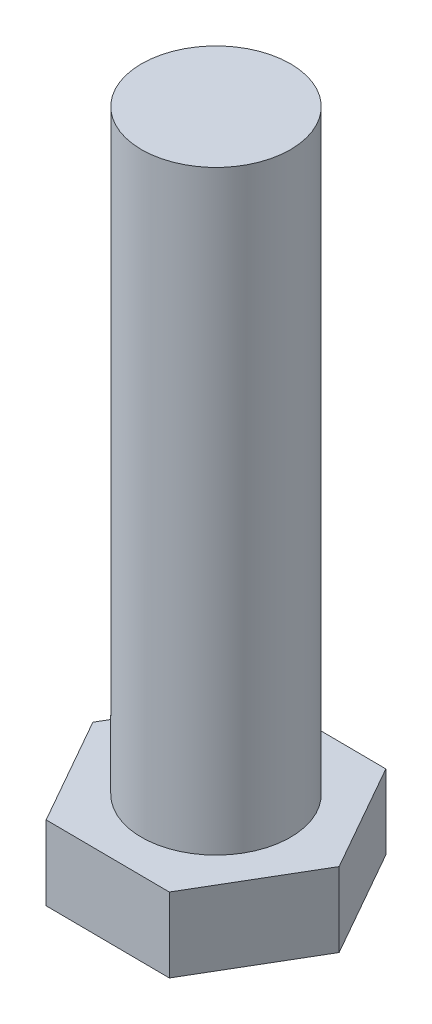
ISO-10303-21;
HEADER;
FILE_DESCRIPTION(('STEP AP214'),'2;1');
FILE_NAME('part.step','',(''),(''),'','','');
FILE_SCHEMA(('AUTOMOTIVE_DESIGN { 1 0 10303 214 1 1 1 1 }'));
ENDSEC;
DATA;
#1=APPLICATION_CONTEXT('core data for automotive mechanical design processes');
#2=APPLICATION_PROTOCOL_DEFINITION('international standard','automotive_design',2000,#1);
#3=PRODUCT_CONTEXT('',#1,'mechanical');
#4=PRODUCT('Part','Part','',(#3));
#5=PRODUCT_RELATED_PRODUCT_CATEGORY('part','',(#4));
#6=PRODUCT_DEFINITION_FORMATION('','',#4);
#7=PRODUCT_DEFINITION_CONTEXT('part definition',#1,'design');
#8=PRODUCT_DEFINITION('design','',#6,#7);
#9=PRODUCT_DEFINITION_SHAPE('','',#8);
#10=(LENGTH_UNIT() NAMED_UNIT(*) SI_UNIT(.MILLI.,.METRE.));
#11=(NAMED_UNIT(*) PLANE_ANGLE_UNIT() SI_UNIT($,.RADIAN.));
#12=(NAMED_UNIT(*) SI_UNIT($,.STERADIAN.) SOLID_ANGLE_UNIT());
#13=UNCERTAINTY_MEASURE_WITH_UNIT(LENGTH_MEASURE(1.E-05),#10,'distance_accuracy_value','');
#14=(GEOMETRIC_REPRESENTATION_CONTEXT(3) GLOBAL_UNCERTAINTY_ASSIGNED_CONTEXT((#13)) GLOBAL_UNIT_ASSIGNED_CONTEXT((#10,
#11,#12)) REPRESENTATION_CONTEXT('',''));
#15=CARTESIAN_POINT('',(0.,0.,0.));
#16=DIRECTION('',(0.,0.,1.));
#17=DIRECTION('',(1.,0.,0.));
#18=AXIS2_PLACEMENT_3D('',#15,#16,#17);
#19=CARTESIAN_POINT('',(0.,12.,0.));
#20=DIRECTION('',(0.,-1.,0.));
#21=DIRECTION('',(0.,0.,-1.));
#22=AXIS2_PLACEMENT_3D('',#19,#20,#21);
#23=CYLINDRICAL_SURFACE('',#22,1.5);
#24=CARTESIAN_POINT('',(0.,12.,0.));
#25=DIRECTION('',(0.,1.,0.));
#26=DIRECTION('',(0.,0.,1.));
#27=AXIS2_PLACEMENT_3D('',#24,#25,#26);
#28=CIRCLE('',#27,1.5);
#29=CARTESIAN_POINT('',(0.,12.,1.5));
#30=VERTEX_POINT('',#29);
#31=EDGE_CURVE('E11',#30,#30,#28,.T.);
#32=ORIENTED_EDGE('',*,*,#31,.F.);
#33=EDGE_LOOP('',(#32));
#34=FACE_BOUND('',#33,.T.);
#35=CARTESIAN_POINT('',(0.,0.,0.));
#36=DIRECTION('',(0.,-1.,0.));
#37=DIRECTION('',(0.,0.,-1.));
#38=AXIS2_PLACEMENT_3D('',#35,#36,#37);
#39=CIRCLE('',#38,1.5);
#40=CARTESIAN_POINT('',(0.,0.,-1.5));
#41=VERTEX_POINT('',#40);
#42=EDGE_CURVE('E43',#41,#41,#39,.T.);
#43=ORIENTED_EDGE('',*,*,#42,.F.);
#44=EDGE_LOOP('',(#43));
#45=FACE_BOUND('',#44,.T.);
#46=ADVANCED_FACE('F35',(#34,#45),#23,.T.);
#47=CARTESIAN_POINT('',(0.,12.,0.));
#48=DIRECTION('',(0.,1.,0.));
#49=DIRECTION('',(0.,0.,1.));
#50=AXIS2_PLACEMENT_3D('',#47,#48,#49);
#51=PLANE('',#50);
#52=ORIENTED_EDGE('',*,*,#31,.T.);
#53=EDGE_LOOP('',(#52));
#54=FACE_BOUND('',#53,.T.);
#55=ADVANCED_FACE('F145',(#54),#51,.T.);
#56=CARTESIAN_POINT('',(1.26636513009753,-1.5,-2.15561509719396));
#57=DIRECTION('',(-0.869779921870773,0.,0.493439851968274));
#58=DIRECTION('',(0.493439851968274,0.,0.869779921870773));
#59=AXIS2_PLACEMENT_3D('',#56,#57,#58);
#60=PLANE('',#59);
#61=DIRECTION('',(0.493439851968274,0.,0.869779921870773));
#62=VECTOR('',#61,1.);
#63=CARTESIAN_POINT('',(1.26636513009753,0.,-2.15561509719396));
#64=LINE('',#63,#62);
#65=CARTESIAN_POINT('',(1.26636513009753,0.,-2.15561509719396));
#66=VERTEX_POINT('',#65);
#67=CARTESIAN_POINT('',(2.5,0.,0.0188968245342703));
#68=VERTEX_POINT('',#67);
#69=EDGE_CURVE('E120',#66,#68,#64,.T.);
#70=ORIENTED_EDGE('',*,*,#69,.T.);
#71=DIRECTION('',(0.,1.,0.));
#72=VECTOR('',#71,1.);
#73=CARTESIAN_POINT('',(2.5,-1.5,0.0188968245342703));
#74=LINE('',#73,#72);
#75=CARTESIAN_POINT('',(2.5,-1.5,0.0188968245342703));
#76=VERTEX_POINT('',#75);
#77=EDGE_CURVE('E137',#76,#68,#74,.T.);
#78=ORIENTED_EDGE('',*,*,#77,.F.);
#79=DIRECTION('',(0.493439851968274,0.,0.869779921870773));
#80=VECTOR('',#79,1.);
#81=CARTESIAN_POINT('',(1.26636513009753,-1.5,-2.15561509719396));
#82=LINE('',#81,#80);
#83=CARTESIAN_POINT('',(1.26636513009753,-1.5,-2.15561509719396));
#84=VERTEX_POINT('',#83);
#85=EDGE_CURVE('E130',#84,#76,#82,.T.);
#86=ORIENTED_EDGE('',*,*,#85,.F.);
#87=DIRECTION('',(0.,1.,0.));
#88=VECTOR('',#87,1.);
#89=CARTESIAN_POINT('',(1.26636513009753,-1.5,-2.15561509719396));
#90=LINE('',#89,#88);
#91=EDGE_CURVE('E116',#84,#66,#90,.T.);
#92=ORIENTED_EDGE('',*,*,#91,.T.);
#93=EDGE_LOOP('',(#70,#78,#86,#92));
#94=FACE_BOUND('',#93,.T.);
#95=ADVANCED_FACE('F150',(#94),#60,.F.);
#96=CARTESIAN_POINT('',(2.5,-1.5,0.0188968245342703));
#97=DIRECTION('',(-0.862221407979545,0.,-0.506531582057596));
#98=DIRECTION('',(-0.506531582057596,0.,0.862221407979545));
#99=AXIS2_PLACEMENT_3D('',#96,#97,#98);
#100=PLANE('',#99);
#101=DIRECTION('',(-0.506531582057596,0.,0.862221407979545));
#102=VECTOR('',#101,1.);
#103=CARTESIAN_POINT('',(2.5,0.,0.0188968245342703));
#104=LINE('',#103,#102);
#105=CARTESIAN_POINT('',(1.23363486990247,0.,2.17451192172823));
#106=VERTEX_POINT('',#105);
#107=EDGE_CURVE('E123',#68,#106,#104,.T.);
#108=ORIENTED_EDGE('',*,*,#107,.T.);
#109=DIRECTION('',(0.,1.,0.));
#110=VECTOR('',#109,1.);
#111=CARTESIAN_POINT('',(1.23363486990247,-1.5,2.17451192172823));
#112=LINE('',#111,#110);
#113=CARTESIAN_POINT('',(1.23363486990247,-1.5,2.17451192172823));
#114=VERTEX_POINT('',#113);
#115=EDGE_CURVE('E134',#114,#106,#112,.T.);
#116=ORIENTED_EDGE('',*,*,#115,.F.);
#117=DIRECTION('',(-0.506531582057596,0.,0.862221407979545));
#118=VECTOR('',#117,1.);
#119=CARTESIAN_POINT('',(2.5,-1.5,0.0188968245342703));
#120=LINE('',#119,#118);
#121=EDGE_CURVE('E89',#76,#114,#120,.T.);
#122=ORIENTED_EDGE('',*,*,#121,.F.);
#123=ORIENTED_EDGE('',*,*,#77,.T.);
#124=EDGE_LOOP('',(#108,#116,#122,#123));
#125=FACE_BOUND('',#124,.T.);
#126=ADVANCED_FACE('F156',(#125),#100,.F.);
#127=CARTESIAN_POINT('',(1.23363486990247,-1.5,2.17451192172823));
#128=DIRECTION('',(0.00755851389122729,0.,-0.999971434025871));
#129=DIRECTION('',(-0.999971434025871,0.,-0.00755851389122729));
#130=AXIS2_PLACEMENT_3D('',#127,#128,#129);
#131=PLANE('',#130);
#132=DIRECTION('',(-0.999971434025871,0.,-0.00755851389122729));
#133=VECTOR('',#132,1.);
#134=CARTESIAN_POINT('',(1.23363486990247,0.,2.17451192172823));
#135=LINE('',#134,#133);
#136=CARTESIAN_POINT('',(-1.26636513009753,0.,2.15561509719396));
#137=VERTEX_POINT('',#136);
#138=EDGE_CURVE('E125',#106,#137,#135,.T.);
#139=ORIENTED_EDGE('',*,*,#138,.T.);
#140=DIRECTION('',(0.,1.,0.));
#141=VECTOR('',#140,1.);
#142=CARTESIAN_POINT('',(-1.26636513009753,-1.5,2.15561509719396));
#143=LINE('',#142,#141);
#144=CARTESIAN_POINT('',(-1.26636513009753,-1.5,2.15561509719396));
#145=VERTEX_POINT('',#144);
#146=EDGE_CURVE('E111',#145,#137,#143,.T.);
#147=ORIENTED_EDGE('',*,*,#146,.F.);
#148=DIRECTION('',(-0.999971434025871,0.,-0.00755851389122729));
#149=VECTOR('',#148,1.);
#150=CARTESIAN_POINT('',(1.23363486990247,-1.5,2.17451192172823));
#151=LINE('',#150,#149);
#152=EDGE_CURVE('E102',#114,#145,#151,.T.);
#153=ORIENTED_EDGE('',*,*,#152,.F.);
#154=ORIENTED_EDGE('',*,*,#115,.T.);
#155=EDGE_LOOP('',(#139,#147,#153,#154));
#156=FACE_BOUND('',#155,.T.);
#157=ADVANCED_FACE('F162',(#156),#131,.F.);
#158=CARTESIAN_POINT('',(-1.26636513009753,-1.5,2.15561509719396));
#159=DIRECTION('',(0.869779921870773,0.,-0.493439851968275));
#160=DIRECTION('',(-0.493439851968275,0.,-0.869779921870773));
#161=AXIS2_PLACEMENT_3D('',#158,#159,#160);
#162=PLANE('',#161);
#163=DIRECTION('',(-0.493439851968275,0.,-0.869779921870773));
#164=VECTOR('',#163,1.);
#165=CARTESIAN_POINT('',(-1.26636513009753,0.,2.15561509719396));
#166=LINE('',#165,#164);
#167=CARTESIAN_POINT('',(-2.5,0.,-0.0188968245342696));
#168=VERTEX_POINT('',#167);
#169=EDGE_CURVE('E110',#137,#168,#166,.T.);
#170=ORIENTED_EDGE('',*,*,#169,.T.);
#171=DIRECTION('',(0.,1.,0.));
#172=VECTOR('',#171,1.);
#173=CARTESIAN_POINT('',(-2.5,-1.5,-0.0188968245342696));
#174=LINE('',#173,#172);
#175=CARTESIAN_POINT('',(-2.5,-1.5,-0.0188968245342696));
#176=VERTEX_POINT('',#175);
#177=EDGE_CURVE('E107',#176,#168,#174,.T.);
#178=ORIENTED_EDGE('',*,*,#177,.F.);
#179=DIRECTION('',(-0.493439851968275,0.,-0.869779921870773));
#180=VECTOR('',#179,1.);
#181=CARTESIAN_POINT('',(-1.26636513009753,-1.5,2.15561509719396));
#182=LINE('',#181,#180);
#183=EDGE_CURVE('E96',#145,#176,#182,.T.);
#184=ORIENTED_EDGE('',*,*,#183,.F.);
#185=ORIENTED_EDGE('',*,*,#146,.T.);
#186=EDGE_LOOP('',(#170,#178,#184,#185));
#187=FACE_BOUND('',#186,.T.);
#188=ADVANCED_FACE('F108',(#187),#162,.F.);
#189=CARTESIAN_POINT('',(-2.5,-1.5,-0.0188968245342696));
#190=DIRECTION('',(0.862221407979545,0.,0.506531582057596));
#191=DIRECTION('',(0.506531582057596,0.,-0.862221407979545));
#192=AXIS2_PLACEMENT_3D('',#189,#190,#191);
#193=PLANE('',#192);
#194=DIRECTION('',(0.506531582057596,0.,-0.862221407979545));
#195=VECTOR('',#194,1.);
#196=CARTESIAN_POINT('',(-2.5,0.,-0.0188968245342696));
#197=LINE('',#196,#195);
#198=CARTESIAN_POINT('',(-1.23363486990247,0.,-2.17451192172823));
#199=VERTEX_POINT('',#198);
#200=EDGE_CURVE('E74',#168,#199,#197,.T.);
#201=ORIENTED_EDGE('',*,*,#200,.T.);
#202=DIRECTION('',(0.,1.,0.));
#203=VECTOR('',#202,1.);
#204=CARTESIAN_POINT('',(-1.23363486990247,-1.5,-2.17451192172823));
#205=LINE('',#204,#203);
#206=CARTESIAN_POINT('',(-1.23363486990247,-1.5,-2.17451192172823));
#207=VERTEX_POINT('',#206);
#208=EDGE_CURVE('E112',#207,#199,#205,.T.);
#209=ORIENTED_EDGE('',*,*,#208,.F.);
#210=DIRECTION('',(0.506531582057596,0.,-0.862221407979545));
#211=VECTOR('',#210,1.);
#212=CARTESIAN_POINT('',(-2.5,-1.5,-0.0188968245342696));
#213=LINE('',#212,#211);
#214=EDGE_CURVE('E100',#176,#207,#213,.T.);
#215=ORIENTED_EDGE('',*,*,#214,.F.);
#216=ORIENTED_EDGE('',*,*,#177,.T.);
#217=EDGE_LOOP('',(#201,#209,#215,#216));
#218=FACE_BOUND('',#217,.T.);
#219=ADVANCED_FACE('F114',(#218),#193,.F.);
#220=CARTESIAN_POINT('',(-1.23363486990247,-1.5,-2.17451192172823));
#221=DIRECTION('',(-0.00755851389122764,0.,0.999971434025871));
#222=DIRECTION('',(0.999971434025871,0.,0.00755851389122764));
#223=AXIS2_PLACEMENT_3D('',#220,#221,#222);
#224=PLANE('',#223);
#225=DIRECTION('',(0.999971434025871,0.,0.00755851389122764));
#226=VECTOR('',#225,1.);
#227=CARTESIAN_POINT('',(-1.23363486990247,0.,-2.17451192172823));
#228=LINE('',#227,#226);
#229=EDGE_CURVE('E80',#199,#66,#228,.T.);
#230=ORIENTED_EDGE('',*,*,#229,.T.);
#231=ORIENTED_EDGE('',*,*,#91,.F.);
#232=DIRECTION('',(0.999971434025871,0.,0.00755851389122764));
#233=VECTOR('',#232,1.);
#234=CARTESIAN_POINT('',(-1.23363486990247,-1.5,-2.17451192172823));
#235=LINE('',#234,#233);
#236=EDGE_CURVE('E51',#207,#84,#235,.T.);
#237=ORIENTED_EDGE('',*,*,#236,.F.);
#238=ORIENTED_EDGE('',*,*,#208,.T.);
#239=EDGE_LOOP('',(#230,#231,#237,#238));
#240=FACE_BOUND('',#239,.T.);
#241=ADVANCED_FACE('F170',(#240),#224,.F.);
#242=CARTESIAN_POINT('',(0.,-1.5,0.));
#243=DIRECTION('',(0.,-1.,0.));
#244=DIRECTION('',(0.,0.,-1.));
#245=AXIS2_PLACEMENT_3D('',#242,#243,#244);
#246=PLANE('',#245);
#247=ORIENTED_EDGE('',*,*,#85,.T.);
#248=ORIENTED_EDGE('',*,*,#121,.T.);
#249=ORIENTED_EDGE('',*,*,#152,.T.);
#250=ORIENTED_EDGE('',*,*,#183,.T.);
#251=ORIENTED_EDGE('',*,*,#214,.T.);
#252=ORIENTED_EDGE('',*,*,#236,.T.);
#253=EDGE_LOOP('',(#247,#248,#249,#250,#251,#252));
#254=FACE_BOUND('',#253,.T.);
#255=ADVANCED_FACE('F98',(#254),#246,.T.);
#256=CARTESIAN_POINT('',(0.,0.,0.));
#257=DIRECTION('',(0.,-1.,0.));
#258=DIRECTION('',(0.,0.,-1.));
#259=AXIS2_PLACEMENT_3D('',#256,#257,#258);
#260=PLANE('',#259);
#261=ORIENTED_EDGE('',*,*,#42,.T.);
#262=EDGE_LOOP('',(#261));
#263=FACE_BOUND('',#262,.T.);
#264=ORIENTED_EDGE('',*,*,#69,.F.);
#265=ORIENTED_EDGE('',*,*,#229,.F.);
#266=ORIENTED_EDGE('',*,*,#200,.F.);
#267=ORIENTED_EDGE('',*,*,#169,.F.);
#268=ORIENTED_EDGE('',*,*,#138,.F.);
#269=ORIENTED_EDGE('',*,*,#107,.F.);
#270=EDGE_LOOP('',(#264,#265,#266,#267,#268,#269));
#271=FACE_BOUND('',#270,.T.);
#272=ADVANCED_FACE('F141',(#263,#271),#260,.F.);
#273=CLOSED_SHELL('',(#46,#55,#95,#126,#157,#188,#219,#241,#255,#272));
#274=MANIFOLD_SOLID_BREP('B2',#273);
#275=ADVANCED_BREP_SHAPE_REPRESENTATION('',(#18,#274),#14);
#276=SHAPE_DEFINITION_REPRESENTATION(#9,#275);
ENDSEC;
END-ISO-10303-21;
